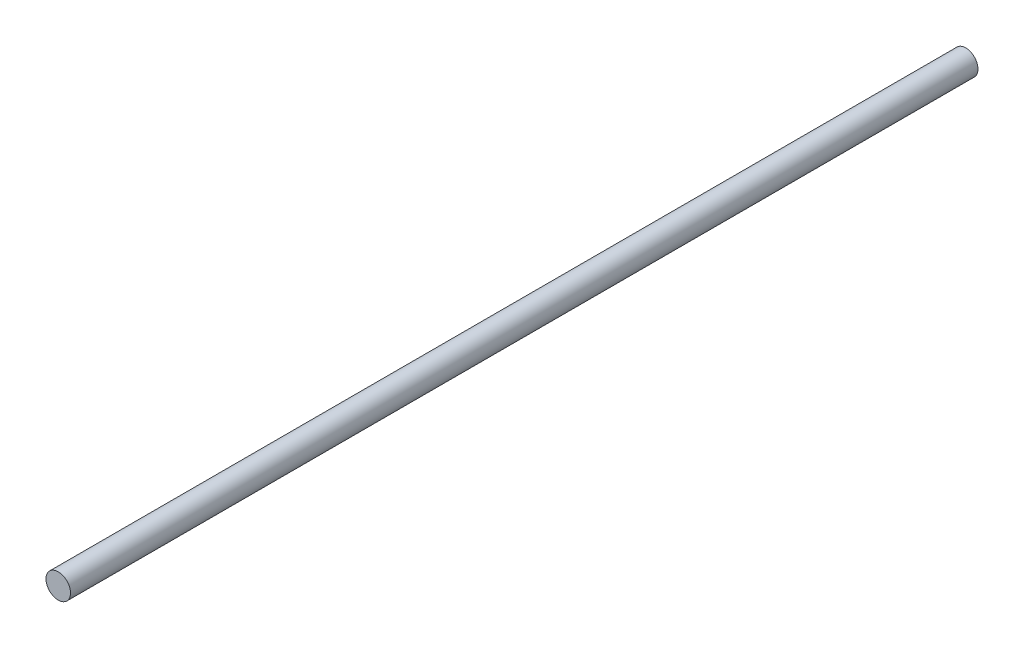
ISO-10303-21;
HEADER;
FILE_DESCRIPTION(('STEP AP214'),'2;1');
FILE_NAME('part.step','',(''),(''),'','','');
FILE_SCHEMA(('AUTOMOTIVE_DESIGN { 1 0 10303 214 1 1 1 1 }'));
ENDSEC;
DATA;
#1=APPLICATION_CONTEXT('core data for automotive mechanical design processes');
#2=APPLICATION_PROTOCOL_DEFINITION('international standard','automotive_design',2000,#1);
#3=PRODUCT_CONTEXT('',#1,'mechanical');
#4=PRODUCT('Part','Part','',(#3));
#5=PRODUCT_RELATED_PRODUCT_CATEGORY('part','',(#4));
#6=PRODUCT_DEFINITION_FORMATION('','',#4);
#7=PRODUCT_DEFINITION_CONTEXT('part definition',#1,'design');
#8=PRODUCT_DEFINITION('design','',#6,#7);
#9=PRODUCT_DEFINITION_SHAPE('','',#8);
#10=(LENGTH_UNIT() NAMED_UNIT(*) SI_UNIT(.MILLI.,.METRE.));
#11=(NAMED_UNIT(*) PLANE_ANGLE_UNIT() SI_UNIT($,.RADIAN.));
#12=(NAMED_UNIT(*) SI_UNIT($,.STERADIAN.) SOLID_ANGLE_UNIT());
#13=UNCERTAINTY_MEASURE_WITH_UNIT(LENGTH_MEASURE(1.E-05),#10,'distance_accuracy_value','');
#14=(GEOMETRIC_REPRESENTATION_CONTEXT(3) GLOBAL_UNCERTAINTY_ASSIGNED_CONTEXT((#13)) GLOBAL_UNIT_ASSIGNED_CONTEXT((#10,
#11,#12)) REPRESENTATION_CONTEXT('',''));
#15=CARTESIAN_POINT('',(0.,0.,0.));
#16=DIRECTION('',(0.,0.,1.));
#17=DIRECTION('',(1.,0.,0.));
#18=AXIS2_PLACEMENT_3D('',#15,#16,#17);
#19=CARTESIAN_POINT('',(0.,0.,152.4));
#20=DIRECTION('',(0.,0.,-1.));
#21=DIRECTION('',(-1.,0.,0.));
#22=AXIS2_PLACEMENT_3D('',#19,#20,#21);
#23=CYLINDRICAL_SURFACE('',#22,2.06121);
#24=CARTESIAN_POINT('',(0.,0.,152.4));
#25=DIRECTION('',(0.,0.,1.));
#26=DIRECTION('',(1.,0.,0.));
#27=AXIS2_PLACEMENT_3D('',#24,#25,#26);
#28=CIRCLE('',#27,2.06121);
#29=CARTESIAN_POINT('',(2.06121,0.,152.4));
#30=VERTEX_POINT('',#29);
#31=EDGE_CURVE('E10',#30,#30,#28,.T.);
#32=ORIENTED_EDGE('',*,*,#31,.F.);
#33=EDGE_LOOP('',(#32));
#34=FACE_BOUND('',#33,.T.);
#35=CARTESIAN_POINT('',(0.,0.,0.));
#36=DIRECTION('',(0.,0.,1.));
#37=DIRECTION('',(1.,0.,0.));
#38=AXIS2_PLACEMENT_3D('',#35,#36,#37);
#39=CIRCLE('',#38,2.06121);
#40=CARTESIAN_POINT('',(2.06121,0.,0.));
#41=VERTEX_POINT('',#40);
#42=EDGE_CURVE('E34',#41,#41,#39,.T.);
#43=ORIENTED_EDGE('',*,*,#42,.T.);
#44=EDGE_LOOP('',(#43));
#45=FACE_BOUND('',#44,.T.);
#46=ADVANCED_FACE('F31',(#34,#45),#23,.T.);
#47=CARTESIAN_POINT('',(0.,0.,152.4));
#48=DIRECTION('',(0.,0.,1.));
#49=DIRECTION('',(1.,0.,0.));
#50=AXIS2_PLACEMENT_3D('',#47,#48,#49);
#51=PLANE('',#50);
#52=ORIENTED_EDGE('',*,*,#31,.T.);
#53=EDGE_LOOP('',(#52));
#54=FACE_BOUND('',#53,.T.);
#55=ADVANCED_FACE('F46',(#54),#51,.T.);
#56=CARTESIAN_POINT('',(0.,0.,0.));
#57=DIRECTION('',(0.,0.,1.));
#58=DIRECTION('',(1.,0.,0.));
#59=AXIS2_PLACEMENT_3D('',#56,#57,#58);
#60=PLANE('',#59);
#61=ORIENTED_EDGE('',*,*,#42,.F.);
#62=EDGE_LOOP('',(#61));
#63=FACE_BOUND('',#62,.T.);
#64=ADVANCED_FACE('F44',(#63),#60,.F.);
#65=CLOSED_SHELL('',(#46,#55,#64));
#66=MANIFOLD_SOLID_BREP('B2',#65);
#67=ADVANCED_BREP_SHAPE_REPRESENTATION('',(#18,#66),#14);
#68=SHAPE_DEFINITION_REPRESENTATION(#9,#67);
ENDSEC;
END-ISO-10303-21;
